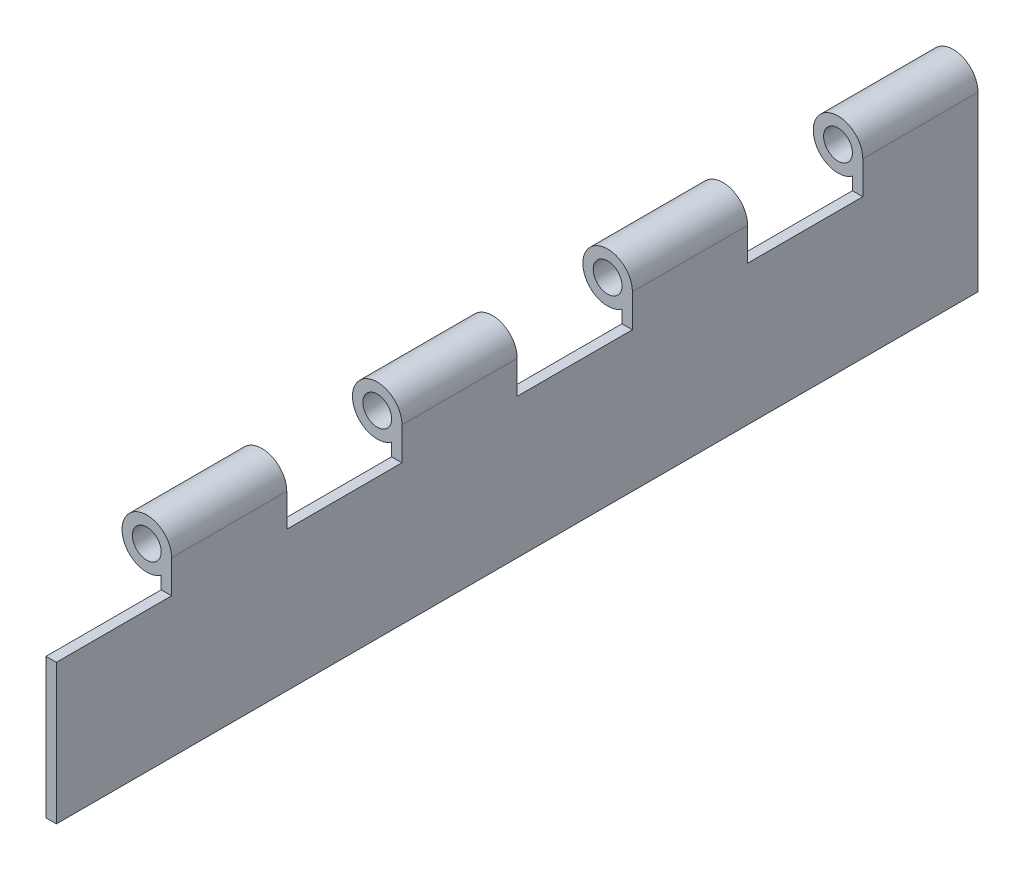
ISO-10303-21;
HEADER;
FILE_DESCRIPTION(('STEP AP214'),'2;1');
FILE_NAME('part.step','',(''),(''),'','','');
FILE_SCHEMA(('AUTOMOTIVE_DESIGN { 1 0 10303 214 1 1 1 1 }'));
ENDSEC;
DATA;
#1=APPLICATION_CONTEXT('core data for automotive mechanical design processes');
#2=APPLICATION_PROTOCOL_DEFINITION('international standard','automotive_design',2000,#1);
#3=PRODUCT_CONTEXT('',#1,'mechanical');
#4=PRODUCT('Part','Part','',(#3));
#5=PRODUCT_RELATED_PRODUCT_CATEGORY('part','',(#4));
#6=PRODUCT_DEFINITION_FORMATION('','',#4);
#7=PRODUCT_DEFINITION_CONTEXT('part definition',#1,'design');
#8=PRODUCT_DEFINITION('design','',#6,#7);
#9=PRODUCT_DEFINITION_SHAPE('','',#8);
#10=(LENGTH_UNIT() NAMED_UNIT(*) SI_UNIT(.MILLI.,.METRE.));
#11=(NAMED_UNIT(*) PLANE_ANGLE_UNIT() SI_UNIT($,.RADIAN.));
#12=(NAMED_UNIT(*) SI_UNIT($,.STERADIAN.) SOLID_ANGLE_UNIT());
#13=UNCERTAINTY_MEASURE_WITH_UNIT(LENGTH_MEASURE(1.E-05),#10,'distance_accuracy_value','');
#14=(GEOMETRIC_REPRESENTATION_CONTEXT(3) GLOBAL_UNCERTAINTY_ASSIGNED_CONTEXT((#13)) GLOBAL_UNIT_ASSIGNED_CONTEXT((#10,
#11,#12)) REPRESENTATION_CONTEXT('',''));
#15=CARTESIAN_POINT('',(0.,0.,0.));
#16=DIRECTION('',(0.,0.,1.));
#17=DIRECTION('',(1.,0.,0.));
#18=AXIS2_PLACEMENT_3D('',#15,#16,#17);
#19=CARTESIAN_POINT('',(0.,0.,203.2));
#20=DIRECTION('',(0.,0.,-1.));
#21=DIRECTION('',(-1.,0.,0.));
#22=AXIS2_PLACEMENT_3D('',#19,#20,#21);
#23=CYLINDRICAL_SURFACE('',#22,5.461);
#24=DIRECTION('',(0.,0.,-1.));
#25=VECTOR('',#24,1.);
#26=CARTESIAN_POINT('',(5.461,0.,203.2));
#27=LINE('',#26,#25);
#28=CARTESIAN_POINT('',(5.461,0.,177.8));
#29=VERTEX_POINT('',#28);
#30=CARTESIAN_POINT('',(5.461,0.,152.4));
#31=VERTEX_POINT('',#30);
#32=EDGE_CURVE('E295',#29,#31,#27,.T.);
#33=ORIENTED_EDGE('',*,*,#32,.T.);
#34=CARTESIAN_POINT('',(0.,0.,152.4));
#35=DIRECTION('',(0.,0.,1.));
#36=DIRECTION('',(1.,0.,0.));
#37=AXIS2_PLACEMENT_3D('',#34,#35,#36);
#38=CIRCLE('',#37,5.461);
#39=CARTESIAN_POINT('',(3.17500000000001,-4.44318534387211,152.4));
#40=VERTEX_POINT('',#39);
#41=EDGE_CURVE('E245',#31,#40,#38,.T.);
#42=ORIENTED_EDGE('',*,*,#41,.T.);
#43=DIRECTION('',(0.,0.,-1.));
#44=VECTOR('',#43,1.);
#45=CARTESIAN_POINT('',(3.17500000000001,-4.44318534387211,203.2));
#46=LINE('',#45,#44);
#47=CARTESIAN_POINT('',(3.17500000000001,-4.44318534387211,177.8));
#48=VERTEX_POINT('',#47);
#49=EDGE_CURVE('E11',#48,#40,#46,.T.);
#50=ORIENTED_EDGE('',*,*,#49,.F.);
#51=CARTESIAN_POINT('',(0.,0.,177.8));
#52=DIRECTION('',(0.,0.,-1.));
#53=DIRECTION('',(-1.,0.,0.));
#54=AXIS2_PLACEMENT_3D('',#51,#52,#53);
#55=CIRCLE('',#54,5.461);
#56=EDGE_CURVE('E269',#48,#29,#55,.T.);
#57=ORIENTED_EDGE('',*,*,#56,.T.);
#58=EDGE_LOOP('',(#33,#42,#50,#57));
#59=FACE_BOUND('',#58,.T.);
#60=ADVANCED_FACE('F36',(#59),#23,.T.);
#61=CARTESIAN_POINT('',(3.17500000000001,-4.44318534387211,127.));
#62=VERTEX_POINT('',#61);
#63=CARTESIAN_POINT('',(3.17500000000001,-4.44318534387211,101.6));
#64=VERTEX_POINT('',#63);
#65=EDGE_CURVE('E45',#62,#64,#46,.T.);
#66=ORIENTED_EDGE('',*,*,#65,.F.);
#67=CARTESIAN_POINT('',(0.,0.,127.));
#68=DIRECTION('',(0.,0.,-1.));
#69=DIRECTION('',(-1.,0.,0.));
#70=AXIS2_PLACEMENT_3D('',#67,#68,#69);
#71=CIRCLE('',#70,5.461);
#72=CARTESIAN_POINT('',(5.461,0.,127.));
#73=VERTEX_POINT('',#72);
#74=EDGE_CURVE('E240',#62,#73,#71,.T.);
#75=ORIENTED_EDGE('',*,*,#74,.T.);
#76=CARTESIAN_POINT('',(5.461,0.,101.6));
#77=VERTEX_POINT('',#76);
#78=EDGE_CURVE('E186',#73,#77,#27,.T.);
#79=ORIENTED_EDGE('',*,*,#78,.T.);
#80=CARTESIAN_POINT('',(0.,0.,101.6));
#81=DIRECTION('',(0.,0.,1.));
#82=DIRECTION('',(1.,0.,0.));
#83=AXIS2_PLACEMENT_3D('',#80,#81,#82);
#84=CIRCLE('',#83,5.461);
#85=EDGE_CURVE('E236',#77,#64,#84,.T.);
#86=ORIENTED_EDGE('',*,*,#85,.T.);
#87=EDGE_LOOP('',(#66,#75,#79,#86));
#88=FACE_BOUND('',#87,.T.);
#89=ADVANCED_FACE('F340',(#88),#23,.T.);
#90=CARTESIAN_POINT('',(3.17500000000001,-4.44318534387211,76.2));
#91=VERTEX_POINT('',#90);
#92=CARTESIAN_POINT('',(3.17500000000001,-4.44318534387211,50.8));
#93=VERTEX_POINT('',#92);
#94=EDGE_CURVE('E370',#91,#93,#46,.T.);
#95=ORIENTED_EDGE('',*,*,#94,.F.);
#96=CARTESIAN_POINT('',(0.,0.,76.2));
#97=DIRECTION('',(0.,0.,-1.));
#98=DIRECTION('',(-1.,0.,0.));
#99=AXIS2_PLACEMENT_3D('',#96,#97,#98);
#100=CIRCLE('',#99,5.461);
#101=CARTESIAN_POINT('',(5.461,0.,76.2));
#102=VERTEX_POINT('',#101);
#103=EDGE_CURVE('E230',#91,#102,#100,.T.);
#104=ORIENTED_EDGE('',*,*,#103,.T.);
#105=CARTESIAN_POINT('',(5.461,0.,50.8));
#106=VERTEX_POINT('',#105);
#107=EDGE_CURVE('E382',#102,#106,#27,.T.);
#108=ORIENTED_EDGE('',*,*,#107,.T.);
#109=CARTESIAN_POINT('',(0.,0.,50.8));
#110=DIRECTION('',(0.,0.,1.));
#111=DIRECTION('',(1.,0.,0.));
#112=AXIS2_PLACEMENT_3D('',#109,#110,#111);
#113=CIRCLE('',#112,5.461);
#114=EDGE_CURVE('E224',#106,#93,#113,.T.);
#115=ORIENTED_EDGE('',*,*,#114,.T.);
#116=EDGE_LOOP('',(#95,#104,#108,#115));
#117=FACE_BOUND('',#116,.T.);
#118=ADVANCED_FACE('F345',(#117),#23,.T.);
#119=CARTESIAN_POINT('',(0.,0.,203.2));
#120=DIRECTION('',(0.,0.,-1.));
#121=DIRECTION('',(-1.,0.,0.));
#122=AXIS2_PLACEMENT_3D('',#119,#120,#121);
#123=CYLINDRICAL_SURFACE('',#122,3.175);
#124=CARTESIAN_POINT('',(0.,0.,152.4));
#125=DIRECTION('',(0.,0.,1.));
#126=DIRECTION('',(1.,0.,0.));
#127=AXIS2_PLACEMENT_3D('',#124,#125,#126);
#128=CIRCLE('',#127,3.175);
#129=CARTESIAN_POINT('',(3.175,0.,152.4));
#130=VERTEX_POINT('',#129);
#131=EDGE_CURVE('E40',#130,#130,#128,.T.);
#132=ORIENTED_EDGE('',*,*,#131,.F.);
#133=EDGE_LOOP('',(#132));
#134=FACE_BOUND('',#133,.T.);
#135=CARTESIAN_POINT('',(0.,0.,177.8));
#136=DIRECTION('',(0.,0.,-1.));
#137=DIRECTION('',(-1.,0.,0.));
#138=AXIS2_PLACEMENT_3D('',#135,#136,#137);
#139=CIRCLE('',#138,3.175);
#140=CARTESIAN_POINT('',(-3.175,0.,177.8));
#141=VERTEX_POINT('',#140);
#142=EDGE_CURVE('E264',#141,#141,#139,.T.);
#143=ORIENTED_EDGE('',*,*,#142,.F.);
#144=EDGE_LOOP('',(#143));
#145=FACE_BOUND('',#144,.T.);
#146=ADVANCED_FACE('F323',(#134,#145),#123,.F.);
#147=CARTESIAN_POINT('',(0.,0.,203.2));
#148=DIRECTION('',(0.,0.,1.));
#149=DIRECTION('',(1.,0.,0.));
#150=AXIS2_PLACEMENT_3D('',#147,#148,#149);
#151=PLANE('',#150);
#152=DIRECTION('',(1.,0.,0.));
#153=VECTOR('',#152,1.);
#154=CARTESIAN_POINT('',(-5.461,-7.239,203.2));
#155=LINE('',#154,#153);
#156=CARTESIAN_POINT('',(3.17500000000001,-7.239,203.2));
#157=VERTEX_POINT('',#156);
#158=CARTESIAN_POINT('',(5.461,-7.239,203.2));
#159=VERTEX_POINT('',#158);
#160=EDGE_CURVE('E261',#157,#159,#155,.T.);
#161=ORIENTED_EDGE('',*,*,#160,.F.);
#162=DIRECTION('',(0.,-1.,0.));
#163=VECTOR('',#162,1.);
#164=CARTESIAN_POINT('',(3.17500000000001,-38.1,203.2));
#165=LINE('',#164,#163);
#166=CARTESIAN_POINT('',(3.17500000000001,-38.1,203.2));
#167=VERTEX_POINT('',#166);
#168=EDGE_CURVE('E278',#157,#167,#165,.T.);
#169=ORIENTED_EDGE('',*,*,#168,.T.);
#170=DIRECTION('',(1.,0.,0.));
#171=VECTOR('',#170,1.);
#172=CARTESIAN_POINT('',(5.461,-38.1,203.2));
#173=LINE('',#172,#171);
#174=CARTESIAN_POINT('',(5.461,-38.1,203.2));
#175=VERTEX_POINT('',#174);
#176=EDGE_CURVE('E280',#167,#175,#173,.T.);
#177=ORIENTED_EDGE('',*,*,#176,.T.);
#178=DIRECTION('',(0.,1.,0.));
#179=VECTOR('',#178,1.);
#180=CARTESIAN_POINT('',(5.461,0.,203.2));
#181=LINE('',#180,#179);
#182=EDGE_CURVE('E283',#175,#159,#181,.T.);
#183=ORIENTED_EDGE('',*,*,#182,.T.);
#184=EDGE_LOOP('',(#161,#169,#177,#183));
#185=FACE_BOUND('',#184,.T.);
#186=ADVANCED_FACE('F357',(#185),#151,.T.);
#187=CARTESIAN_POINT('',(0.,0.,0.));
#188=DIRECTION('',(0.,0.,1.));
#189=DIRECTION('',(1.,0.,0.));
#190=AXIS2_PLACEMENT_3D('',#187,#188,#189);
#191=PLANE('',#190);
#192=CARTESIAN_POINT('',(0.,0.,0.));
#193=DIRECTION('',(0.,0.,1.));
#194=DIRECTION('',(1.,0.,0.));
#195=AXIS2_PLACEMENT_3D('',#192,#193,#194);
#196=CIRCLE('',#195,5.461);
#197=CARTESIAN_POINT('',(5.461,0.,0.));
#198=VERTEX_POINT('',#197);
#199=CARTESIAN_POINT('',(3.17500000000001,-4.44318534387211,0.));
#200=VERTEX_POINT('',#199);
#201=EDGE_CURVE('E277',#198,#200,#196,.T.);
#202=ORIENTED_EDGE('',*,*,#201,.F.);
#203=DIRECTION('',(0.,1.,0.));
#204=VECTOR('',#203,1.);
#205=CARTESIAN_POINT('',(5.461,0.,0.));
#206=LINE('',#205,#204);
#207=CARTESIAN_POINT('',(5.461,-38.1,0.));
#208=VERTEX_POINT('',#207);
#209=EDGE_CURVE('E281',#208,#198,#206,.T.);
#210=ORIENTED_EDGE('',*,*,#209,.F.);
#211=DIRECTION('',(1.,0.,0.));
#212=VECTOR('',#211,1.);
#213=CARTESIAN_POINT('',(5.461,-38.1,0.));
#214=LINE('',#213,#212);
#215=CARTESIAN_POINT('',(3.17500000000001,-38.1,0.));
#216=VERTEX_POINT('',#215);
#217=EDGE_CURVE('E291',#216,#208,#214,.T.);
#218=ORIENTED_EDGE('',*,*,#217,.F.);
#219=DIRECTION('',(0.,-1.,0.));
#220=VECTOR('',#219,1.);
#221=CARTESIAN_POINT('',(3.17500000000001,-38.1,0.));
#222=LINE('',#221,#220);
#223=EDGE_CURVE('E289',#200,#216,#222,.T.);
#224=ORIENTED_EDGE('',*,*,#223,.F.);
#225=EDGE_LOOP('',(#202,#210,#218,#224));
#226=FACE_BOUND('',#225,.T.);
#227=CARTESIAN_POINT('',(0.,0.,0.));
#228=DIRECTION('',(0.,0.,1.));
#229=DIRECTION('',(1.,0.,0.));
#230=AXIS2_PLACEMENT_3D('',#227,#228,#229);
#231=CIRCLE('',#230,3.175);
#232=CARTESIAN_POINT('',(3.175,0.,0.));
#233=VERTEX_POINT('',#232);
#234=EDGE_CURVE('E274',#233,#233,#231,.T.);
#235=ORIENTED_EDGE('',*,*,#234,.T.);
#236=EDGE_LOOP('',(#235));
#237=FACE_BOUND('',#236,.T.);
#238=ADVANCED_FACE('F349',(#226,#237),#191,.F.);
#239=CARTESIAN_POINT('',(3.17500000000001,-4.44318534387211,25.4));
#240=VERTEX_POINT('',#239);
#241=EDGE_CURVE('E47',#240,#200,#46,.T.);
#242=ORIENTED_EDGE('',*,*,#241,.F.);
#243=CARTESIAN_POINT('',(0.,0.,25.4));
#244=DIRECTION('',(0.,0.,-1.));
#245=DIRECTION('',(-1.,0.,0.));
#246=AXIS2_PLACEMENT_3D('',#243,#244,#245);
#247=CIRCLE('',#246,5.461);
#248=CARTESIAN_POINT('',(5.461,0.,25.4));
#249=VERTEX_POINT('',#248);
#250=EDGE_CURVE('E218',#240,#249,#247,.T.);
#251=ORIENTED_EDGE('',*,*,#250,.T.);
#252=EDGE_CURVE('E286',#249,#198,#27,.T.);
#253=ORIENTED_EDGE('',*,*,#252,.T.);
#254=ORIENTED_EDGE('',*,*,#201,.T.);
#255=EDGE_LOOP('',(#242,#251,#253,#254));
#256=FACE_BOUND('',#255,.T.);
#257=ADVANCED_FACE('F38',(#256),#23,.T.);
#258=CARTESIAN_POINT('',(3.17500000000001,-38.1,203.2));
#259=DIRECTION('',(1.,0.,0.));
#260=DIRECTION('',(0.,1.,0.));
#261=AXIS2_PLACEMENT_3D('',#258,#259,#260);
#262=PLANE('',#261);
#263=ORIENTED_EDGE('',*,*,#49,.T.);
#264=DIRECTION('',(0.,-1.,0.));
#265=VECTOR('',#264,1.);
#266=CARTESIAN_POINT('',(3.17500000000001,-38.1,152.4));
#267=LINE('',#266,#265);
#268=CARTESIAN_POINT('',(3.17500000000001,-7.239,152.4));
#269=VERTEX_POINT('',#268);
#270=EDGE_CURVE('E242',#40,#269,#267,.T.);
#271=ORIENTED_EDGE('',*,*,#270,.T.);
#272=DIRECTION('',(0.,0.,-1.));
#273=VECTOR('',#272,1.);
#274=CARTESIAN_POINT('',(3.17500000000001,-7.239,203.2));
#275=LINE('',#274,#273);
#276=CARTESIAN_POINT('',(3.17500000000001,-7.239,127.));
#277=VERTEX_POINT('',#276);
#278=EDGE_CURVE('E253',#269,#277,#275,.T.);
#279=ORIENTED_EDGE('',*,*,#278,.T.);
#280=DIRECTION('',(0.,1.,0.));
#281=VECTOR('',#280,1.);
#282=CARTESIAN_POINT('',(3.17500000000001,-38.1,127.));
#283=LINE('',#282,#281);
#284=EDGE_CURVE('E173',#277,#62,#283,.T.);
#285=ORIENTED_EDGE('',*,*,#284,.T.);
#286=ORIENTED_EDGE('',*,*,#65,.T.);
#287=DIRECTION('',(0.,-1.,0.));
#288=VECTOR('',#287,1.);
#289=CARTESIAN_POINT('',(3.17500000000001,-38.1,101.6));
#290=LINE('',#289,#288);
#291=CARTESIAN_POINT('',(3.17500000000001,-7.239,101.6));
#292=VERTEX_POINT('',#291);
#293=EDGE_CURVE('E233',#64,#292,#290,.T.);
#294=ORIENTED_EDGE('',*,*,#293,.T.);
#295=DIRECTION('',(0.,0.,-1.));
#296=VECTOR('',#295,1.);
#297=CARTESIAN_POINT('',(3.17500000000001,-7.239,203.2));
#298=LINE('',#297,#296);
#299=CARTESIAN_POINT('',(3.17500000000001,-7.239,76.2));
#300=VERTEX_POINT('',#299);
#301=EDGE_CURVE('E250',#292,#300,#298,.T.);
#302=ORIENTED_EDGE('',*,*,#301,.T.);
#303=DIRECTION('',(0.,1.,0.));
#304=VECTOR('',#303,1.);
#305=CARTESIAN_POINT('',(3.17500000000001,-38.1,76.2));
#306=LINE('',#305,#304);
#307=EDGE_CURVE('E227',#300,#91,#306,.T.);
#308=ORIENTED_EDGE('',*,*,#307,.T.);
#309=ORIENTED_EDGE('',*,*,#94,.T.);
#310=DIRECTION('',(0.,-1.,0.));
#311=VECTOR('',#310,1.);
#312=CARTESIAN_POINT('',(3.17500000000001,-38.1,50.8));
#313=LINE('',#312,#311);
#314=CARTESIAN_POINT('',(3.17500000000001,-7.239,50.8));
#315=VERTEX_POINT('',#314);
#316=EDGE_CURVE('E221',#93,#315,#313,.T.);
#317=ORIENTED_EDGE('',*,*,#316,.T.);
#318=DIRECTION('',(0.,0.,-1.));
#319=VECTOR('',#318,1.);
#320=CARTESIAN_POINT('',(3.17500000000001,-7.239,203.2));
#321=LINE('',#320,#319);
#322=CARTESIAN_POINT('',(3.17500000000001,-7.239,25.4));
#323=VERTEX_POINT('',#322);
#324=EDGE_CURVE('E247',#315,#323,#321,.T.);
#325=ORIENTED_EDGE('',*,*,#324,.T.);
#326=DIRECTION('',(0.,1.,0.));
#327=VECTOR('',#326,1.);
#328=CARTESIAN_POINT('',(3.17500000000001,-38.1,25.4));
#329=LINE('',#328,#327);
#330=EDGE_CURVE('E215',#323,#240,#329,.T.);
#331=ORIENTED_EDGE('',*,*,#330,.T.);
#332=ORIENTED_EDGE('',*,*,#241,.T.);
#333=ORIENTED_EDGE('',*,*,#223,.T.);
#334=DIRECTION('',(0.,0.,-1.));
#335=VECTOR('',#334,1.);
#336=CARTESIAN_POINT('',(3.17500000000001,-38.1,203.2));
#337=LINE('',#336,#335);
#338=EDGE_CURVE('E301',#167,#216,#337,.T.);
#339=ORIENTED_EDGE('',*,*,#338,.F.);
#340=ORIENTED_EDGE('',*,*,#168,.F.);
#341=DIRECTION('',(0.,0.,-1.));
#342=VECTOR('',#341,1.);
#343=CARTESIAN_POINT('',(3.17500000000001,-7.239,203.2));
#344=LINE('',#343,#342);
#345=CARTESIAN_POINT('',(3.17500000000001,-7.239,177.8));
#346=VERTEX_POINT('',#345);
#347=EDGE_CURVE('E271',#157,#346,#344,.T.);
#348=ORIENTED_EDGE('',*,*,#347,.T.);
#349=DIRECTION('',(0.,1.,0.));
#350=VECTOR('',#349,1.);
#351=CARTESIAN_POINT('',(3.17500000000001,-38.1,177.8));
#352=LINE('',#351,#350);
#353=EDGE_CURVE('E266',#346,#48,#352,.T.);
#354=ORIENTED_EDGE('',*,*,#353,.T.);
#355=EDGE_LOOP('',(#263,#271,#279,#285,#286,#294,#302,#308,#309,#317,#325,#331,#332,#333,#339,
#340,#348,#354));
#356=FACE_BOUND('',#355,.T.);
#357=ADVANCED_FACE('F348',(#356),#262,.F.);
#358=CARTESIAN_POINT('',(5.461,-38.1,203.2));
#359=DIRECTION('',(0.,1.,0.));
#360=DIRECTION('',(0.,0.,1.));
#361=AXIS2_PLACEMENT_3D('',#358,#359,#360);
#362=PLANE('',#361);
#363=ORIENTED_EDGE('',*,*,#217,.T.);
#364=DIRECTION('',(0.,0.,-1.));
#365=VECTOR('',#364,1.);
#366=CARTESIAN_POINT('',(5.461,-38.1,203.2));
#367=LINE('',#366,#365);
#368=EDGE_CURVE('E298',#175,#208,#367,.T.);
#369=ORIENTED_EDGE('',*,*,#368,.F.);
#370=ORIENTED_EDGE('',*,*,#176,.F.);
#371=ORIENTED_EDGE('',*,*,#338,.T.);
#372=EDGE_LOOP('',(#363,#369,#370,#371));
#373=FACE_BOUND('',#372,.T.);
#374=ADVANCED_FACE('F355',(#373),#362,.F.);
#375=CARTESIAN_POINT('',(5.461,0.,203.2));
#376=DIRECTION('',(-1.,0.,0.));
#377=DIRECTION('',(0.,-1.,0.));
#378=AXIS2_PLACEMENT_3D('',#375,#376,#377);
#379=PLANE('',#378);
#380=DIRECTION('',(0.,0.,-1.));
#381=VECTOR('',#380,1.);
#382=CARTESIAN_POINT('',(5.461,-7.239,152.4));
#383=LINE('',#382,#381);
#384=CARTESIAN_POINT('',(5.461,-7.239,152.4));
#385=VERTEX_POINT('',#384);
#386=CARTESIAN_POINT('',(5.461,-7.239,127.));
#387=VERTEX_POINT('',#386);
#388=EDGE_CURVE('E180',#385,#387,#383,.T.);
#389=ORIENTED_EDGE('',*,*,#388,.F.);
#390=DIRECTION('',(0.,-1.,0.));
#391=VECTOR('',#390,1.);
#392=CARTESIAN_POINT('',(5.461,5.461,152.4));
#393=LINE('',#392,#391);
#394=EDGE_CURVE('E54',#31,#385,#393,.T.);
#395=ORIENTED_EDGE('',*,*,#394,.F.);
#396=ORIENTED_EDGE('',*,*,#32,.F.);
#397=DIRECTION('',(0.,1.,0.));
#398=VECTOR('',#397,1.);
#399=CARTESIAN_POINT('',(5.461,5.461,177.8));
#400=LINE('',#399,#398);
#401=CARTESIAN_POINT('',(5.461,-7.239,177.8));
#402=VERTEX_POINT('',#401);
#403=EDGE_CURVE('E258',#402,#29,#400,.T.);
#404=ORIENTED_EDGE('',*,*,#403,.F.);
#405=DIRECTION('',(0.,0.,-1.));
#406=VECTOR('',#405,1.);
#407=CARTESIAN_POINT('',(5.461,-7.239,203.2));
#408=LINE('',#407,#406);
#409=EDGE_CURVE('E255',#159,#402,#408,.T.);
#410=ORIENTED_EDGE('',*,*,#409,.F.);
#411=ORIENTED_EDGE('',*,*,#182,.F.);
#412=ORIENTED_EDGE('',*,*,#368,.T.);
#413=ORIENTED_EDGE('',*,*,#209,.T.);
#414=ORIENTED_EDGE('',*,*,#252,.F.);
#415=DIRECTION('',(0.,1.,0.));
#416=VECTOR('',#415,1.);
#417=CARTESIAN_POINT('',(5.461,5.461,25.4));
#418=LINE('',#417,#416);
#419=CARTESIAN_POINT('',(5.461,-7.239,25.4));
#420=VERTEX_POINT('',#419);
#421=EDGE_CURVE('E208',#420,#249,#418,.T.);
#422=ORIENTED_EDGE('',*,*,#421,.F.);
#423=DIRECTION('',(0.,0.,-1.));
#424=VECTOR('',#423,1.);
#425=CARTESIAN_POINT('',(5.461,-7.239,50.8));
#426=LINE('',#425,#424);
#427=CARTESIAN_POINT('',(5.461,-7.239,50.8));
#428=VERTEX_POINT('',#427);
#429=EDGE_CURVE('E205',#428,#420,#426,.T.);
#430=ORIENTED_EDGE('',*,*,#429,.F.);
#431=DIRECTION('',(0.,-1.,0.));
#432=VECTOR('',#431,1.);
#433=CARTESIAN_POINT('',(5.461,5.461,50.8));
#434=LINE('',#433,#432);
#435=EDGE_CURVE('E203',#106,#428,#434,.T.);
#436=ORIENTED_EDGE('',*,*,#435,.F.);
#437=ORIENTED_EDGE('',*,*,#107,.F.);
#438=DIRECTION('',(0.,1.,0.));
#439=VECTOR('',#438,1.);
#440=CARTESIAN_POINT('',(5.461,5.461,76.2));
#441=LINE('',#440,#439);
#442=CARTESIAN_POINT('',(5.461,-7.239,76.2));
#443=VERTEX_POINT('',#442);
#444=EDGE_CURVE('E196',#443,#102,#441,.T.);
#445=ORIENTED_EDGE('',*,*,#444,.F.);
#446=DIRECTION('',(0.,0.,-1.));
#447=VECTOR('',#446,1.);
#448=CARTESIAN_POINT('',(5.461,-7.239,101.6));
#449=LINE('',#448,#447);
#450=CARTESIAN_POINT('',(5.461,-7.239,101.6));
#451=VERTEX_POINT('',#450);
#452=EDGE_CURVE('E192',#451,#443,#449,.T.);
#453=ORIENTED_EDGE('',*,*,#452,.F.);
#454=DIRECTION('',(0.,-1.,0.));
#455=VECTOR('',#454,1.);
#456=CARTESIAN_POINT('',(5.461,5.461,101.6));
#457=LINE('',#456,#455);
#458=EDGE_CURVE('E62',#77,#451,#457,.T.);
#459=ORIENTED_EDGE('',*,*,#458,.F.);
#460=ORIENTED_EDGE('',*,*,#78,.F.);
#461=DIRECTION('',(0.,1.,0.));
#462=VECTOR('',#461,1.);
#463=CARTESIAN_POINT('',(5.461,5.461,127.));
#464=LINE('',#463,#462);
#465=EDGE_CURVE('E170',#387,#73,#464,.T.);
#466=ORIENTED_EDGE('',*,*,#465,.F.);
#467=EDGE_LOOP('',(#389,#395,#396,#404,#410,#411,#412,#413,#414,#422,#430,#436,#437,#445,#453,
#459,#460,#466));
#468=FACE_BOUND('',#467,.T.);
#469=ADVANCED_FACE('F184',(#468),#379,.F.);
#470=CARTESIAN_POINT('',(0.,0.,25.4));
#471=DIRECTION('',(0.,0.,-1.));
#472=DIRECTION('',(-1.,0.,0.));
#473=AXIS2_PLACEMENT_3D('',#470,#471,#472);
#474=CIRCLE('',#473,3.175);
#475=CARTESIAN_POINT('',(-3.175,0.,25.4));
#476=VERTEX_POINT('',#475);
#477=EDGE_CURVE('E176',#476,#476,#474,.T.);
#478=ORIENTED_EDGE('',*,*,#477,.F.);
#479=EDGE_LOOP('',(#478));
#480=FACE_BOUND('',#479,.T.);
#481=ORIENTED_EDGE('',*,*,#234,.F.);
#482=EDGE_LOOP('',(#481));
#483=FACE_BOUND('',#482,.T.);
#484=ADVANCED_FACE('F367',(#480,#483),#123,.F.);
#485=CARTESIAN_POINT('',(-5.461,-7.239,203.2));
#486=DIRECTION('',(0.,-1.,0.));
#487=DIRECTION('',(1.,0.,0.));
#488=AXIS2_PLACEMENT_3D('',#485,#486,#487);
#489=PLANE('',#488);
#490=ORIENTED_EDGE('',*,*,#160,.T.);
#491=ORIENTED_EDGE('',*,*,#409,.T.);
#492=DIRECTION('',(1.,0.,0.));
#493=VECTOR('',#492,1.);
#494=CARTESIAN_POINT('',(-5.461,-7.239,177.8));
#495=LINE('',#494,#493);
#496=EDGE_CURVE('E262',#346,#402,#495,.T.);
#497=ORIENTED_EDGE('',*,*,#496,.F.);
#498=ORIENTED_EDGE('',*,*,#347,.F.);
#499=EDGE_LOOP('',(#490,#491,#497,#498));
#500=FACE_BOUND('',#499,.T.);
#501=ADVANCED_FACE('F392',(#500),#489,.F.);
#502=CARTESIAN_POINT('',(-5.461,5.461,177.8));
#503=DIRECTION('',(0.,0.,-1.));
#504=DIRECTION('',(-1.,0.,0.));
#505=AXIS2_PLACEMENT_3D('',#502,#503,#504);
#506=PLANE('',#505);
#507=ORIENTED_EDGE('',*,*,#142,.T.);
#508=EDGE_LOOP('',(#507));
#509=FACE_BOUND('',#508,.T.);
#510=ORIENTED_EDGE('',*,*,#56,.F.);
#511=ORIENTED_EDGE('',*,*,#353,.F.);
#512=ORIENTED_EDGE('',*,*,#496,.T.);
#513=ORIENTED_EDGE('',*,*,#403,.T.);
#514=EDGE_LOOP('',(#510,#511,#512,#513));
#515=FACE_BOUND('',#514,.T.);
#516=ADVANCED_FACE('F397',(#509,#515),#506,.F.);
#517=CARTESIAN_POINT('',(-5.46100000000001,-7.239,50.8));
#518=DIRECTION('',(0.,-1.,0.));
#519=DIRECTION('',(1.,0.,0.));
#520=AXIS2_PLACEMENT_3D('',#517,#518,#519);
#521=PLANE('',#520);
#522=DIRECTION('',(1.,0.,0.));
#523=VECTOR('',#522,1.);
#524=CARTESIAN_POINT('',(-5.46100000000001,-7.239,50.8));
#525=LINE('',#524,#523);
#526=EDGE_CURVE('E211',#315,#428,#525,.T.);
#527=ORIENTED_EDGE('',*,*,#526,.T.);
#528=ORIENTED_EDGE('',*,*,#429,.T.);
#529=DIRECTION('',(1.,0.,0.));
#530=VECTOR('',#529,1.);
#531=CARTESIAN_POINT('',(-5.46100000000001,-7.239,25.4));
#532=LINE('',#531,#530);
#533=EDGE_CURVE('E193',#323,#420,#532,.T.);
#534=ORIENTED_EDGE('',*,*,#533,.F.);
#535=ORIENTED_EDGE('',*,*,#324,.F.);
#536=EDGE_LOOP('',(#527,#528,#534,#535));
#537=FACE_BOUND('',#536,.T.);
#538=ADVANCED_FACE('F414',(#537),#521,.F.);
#539=CARTESIAN_POINT('',(-5.46100000000001,5.461,50.8));
#540=DIRECTION('',(0.,0.,1.));
#541=DIRECTION('',(1.,0.,0.));
#542=AXIS2_PLACEMENT_3D('',#539,#540,#541);
#543=PLANE('',#542);
#544=CARTESIAN_POINT('',(0.,0.,50.8));
#545=DIRECTION('',(0.,0.,1.));
#546=DIRECTION('',(1.,0.,0.));
#547=AXIS2_PLACEMENT_3D('',#544,#545,#546);
#548=CIRCLE('',#547,3.175);
#549=CARTESIAN_POINT('',(3.175,0.,50.8));
#550=VERTEX_POINT('',#549);
#551=EDGE_CURVE('E220',#550,#550,#548,.T.);
#552=ORIENTED_EDGE('',*,*,#551,.T.);
#553=EDGE_LOOP('',(#552));
#554=FACE_BOUND('',#553,.T.);
#555=ORIENTED_EDGE('',*,*,#435,.T.);
#556=ORIENTED_EDGE('',*,*,#526,.F.);
#557=ORIENTED_EDGE('',*,*,#316,.F.);
#558=ORIENTED_EDGE('',*,*,#114,.F.);
#559=EDGE_LOOP('',(#555,#556,#557,#558));
#560=FACE_BOUND('',#559,.T.);
#561=ADVANCED_FACE('F412',(#554,#560),#543,.F.);
#562=CARTESIAN_POINT('',(-5.46100000000001,5.461,25.4));
#563=DIRECTION('',(0.,0.,-1.));
#564=DIRECTION('',(-1.,0.,0.));
#565=AXIS2_PLACEMENT_3D('',#562,#563,#564);
#566=PLANE('',#565);
#567=ORIENTED_EDGE('',*,*,#477,.T.);
#568=EDGE_LOOP('',(#567));
#569=FACE_BOUND('',#568,.T.);
#570=ORIENTED_EDGE('',*,*,#250,.F.);
#571=ORIENTED_EDGE('',*,*,#330,.F.);
#572=ORIENTED_EDGE('',*,*,#533,.T.);
#573=ORIENTED_EDGE('',*,*,#421,.T.);
#574=EDGE_LOOP('',(#570,#571,#572,#573));
#575=FACE_BOUND('',#574,.T.);
#576=ADVANCED_FACE('F417',(#569,#575),#566,.F.);
#577=CARTESIAN_POINT('',(0.,0.,76.2));
#578=DIRECTION('',(0.,0.,-1.));
#579=DIRECTION('',(-1.,0.,0.));
#580=AXIS2_PLACEMENT_3D('',#577,#578,#579);
#581=CIRCLE('',#580,3.175);
#582=CARTESIAN_POINT('',(-3.175,0.,76.2));
#583=VERTEX_POINT('',#582);
#584=EDGE_CURVE('E226',#583,#583,#581,.T.);
#585=ORIENTED_EDGE('',*,*,#584,.F.);
#586=EDGE_LOOP('',(#585));
#587=FACE_BOUND('',#586,.T.);
#588=ORIENTED_EDGE('',*,*,#551,.F.);
#589=EDGE_LOOP('',(#588));
#590=FACE_BOUND('',#589,.T.);
#591=ADVANCED_FACE('F322',(#587,#590),#123,.F.);
#592=CARTESIAN_POINT('',(-5.46100000000001,-7.239,101.6));
#593=DIRECTION('',(0.,-1.,0.));
#594=DIRECTION('',(1.,0.,0.));
#595=AXIS2_PLACEMENT_3D('',#592,#593,#594);
#596=PLANE('',#595);
#597=DIRECTION('',(1.,0.,0.));
#598=VECTOR('',#597,1.);
#599=CARTESIAN_POINT('',(-5.46100000000001,-7.239,101.6));
#600=LINE('',#599,#598);
#601=EDGE_CURVE('E199',#292,#451,#600,.T.);
#602=ORIENTED_EDGE('',*,*,#601,.T.);
#603=ORIENTED_EDGE('',*,*,#452,.T.);
#604=DIRECTION('',(1.,0.,0.));
#605=VECTOR('',#604,1.);
#606=CARTESIAN_POINT('',(-5.46100000000001,-7.239,76.2));
#607=LINE('',#606,#605);
#608=EDGE_CURVE('E200',#300,#443,#607,.T.);
#609=ORIENTED_EDGE('',*,*,#608,.F.);
#610=ORIENTED_EDGE('',*,*,#301,.F.);
#611=EDGE_LOOP('',(#602,#603,#609,#610));
#612=FACE_BOUND('',#611,.T.);
#613=ADVANCED_FACE('F328',(#612),#596,.F.);
#614=CARTESIAN_POINT('',(-5.46100000000001,5.461,101.6));
#615=DIRECTION('',(0.,0.,1.));
#616=DIRECTION('',(1.,0.,0.));
#617=AXIS2_PLACEMENT_3D('',#614,#615,#616);
#618=PLANE('',#617);
#619=CARTESIAN_POINT('',(0.,0.,101.6));
#620=DIRECTION('',(0.,0.,1.));
#621=DIRECTION('',(1.,0.,0.));
#622=AXIS2_PLACEMENT_3D('',#619,#620,#621);
#623=CIRCLE('',#622,3.175);
#624=CARTESIAN_POINT('',(3.175,0.,101.6));
#625=VERTEX_POINT('',#624);
#626=EDGE_CURVE('E232',#625,#625,#623,.T.);
#627=ORIENTED_EDGE('',*,*,#626,.T.);
#628=EDGE_LOOP('',(#627));
#629=FACE_BOUND('',#628,.T.);
#630=ORIENTED_EDGE('',*,*,#458,.T.);
#631=ORIENTED_EDGE('',*,*,#601,.F.);
#632=ORIENTED_EDGE('',*,*,#293,.F.);
#633=ORIENTED_EDGE('',*,*,#85,.F.);
#634=EDGE_LOOP('',(#630,#631,#632,#633));
#635=FACE_BOUND('',#634,.T.);
#636=ADVANCED_FACE('F326',(#629,#635),#618,.F.);
#637=CARTESIAN_POINT('',(-5.46100000000001,5.461,76.2));
#638=DIRECTION('',(0.,0.,-1.));
#639=DIRECTION('',(-1.,0.,0.));
#640=AXIS2_PLACEMENT_3D('',#637,#638,#639);
#641=PLANE('',#640);
#642=ORIENTED_EDGE('',*,*,#584,.T.);
#643=EDGE_LOOP('',(#642));
#644=FACE_BOUND('',#643,.T.);
#645=ORIENTED_EDGE('',*,*,#103,.F.);
#646=ORIENTED_EDGE('',*,*,#307,.F.);
#647=ORIENTED_EDGE('',*,*,#608,.T.);
#648=ORIENTED_EDGE('',*,*,#444,.T.);
#649=EDGE_LOOP('',(#645,#646,#647,#648));
#650=FACE_BOUND('',#649,.T.);
#651=ADVANCED_FACE('F320',(#644,#650),#641,.F.);
#652=CARTESIAN_POINT('',(0.,0.,127.));
#653=DIRECTION('',(0.,0.,-1.));
#654=DIRECTION('',(-1.,0.,0.));
#655=AXIS2_PLACEMENT_3D('',#652,#653,#654);
#656=CIRCLE('',#655,3.175);
#657=CARTESIAN_POINT('',(-3.175,0.,127.));
#658=VERTEX_POINT('',#657);
#659=EDGE_CURVE('E238',#658,#658,#656,.T.);
#660=ORIENTED_EDGE('',*,*,#659,.F.);
#661=EDGE_LOOP('',(#660));
#662=FACE_BOUND('',#661,.T.);
#663=ORIENTED_EDGE('',*,*,#626,.F.);
#664=EDGE_LOOP('',(#663));
#665=FACE_BOUND('',#664,.T.);
#666=ADVANCED_FACE('F317',(#662,#665),#123,.F.);
#667=CARTESIAN_POINT('',(-5.46100000000001,-7.239,152.4));
#668=DIRECTION('',(0.,-1.,0.));
#669=DIRECTION('',(1.,0.,0.));
#670=AXIS2_PLACEMENT_3D('',#667,#668,#669);
#671=PLANE('',#670);
#672=DIRECTION('',(1.,0.,0.));
#673=VECTOR('',#672,1.);
#674=CARTESIAN_POINT('',(-5.46100000000001,-7.239,152.4));
#675=LINE('',#674,#673);
#676=EDGE_CURVE('E177',#269,#385,#675,.T.);
#677=ORIENTED_EDGE('',*,*,#676,.T.);
#678=ORIENTED_EDGE('',*,*,#388,.T.);
#679=DIRECTION('',(1.,0.,0.));
#680=VECTOR('',#679,1.);
#681=CARTESIAN_POINT('',(-5.46100000000001,-7.239,127.));
#682=LINE('',#681,#680);
#683=EDGE_CURVE('E166',#277,#387,#682,.T.);
#684=ORIENTED_EDGE('',*,*,#683,.F.);
#685=ORIENTED_EDGE('',*,*,#278,.F.);
#686=EDGE_LOOP('',(#677,#678,#684,#685));
#687=FACE_BOUND('',#686,.T.);
#688=ADVANCED_FACE('F181',(#687),#671,.F.);
#689=CARTESIAN_POINT('',(-5.46100000000001,5.461,152.4));
#690=DIRECTION('',(0.,0.,1.));
#691=DIRECTION('',(1.,0.,0.));
#692=AXIS2_PLACEMENT_3D('',#689,#690,#691);
#693=PLANE('',#692);
#694=ORIENTED_EDGE('',*,*,#131,.T.);
#695=EDGE_LOOP('',(#694));
#696=FACE_BOUND('',#695,.T.);
#697=ORIENTED_EDGE('',*,*,#394,.T.);
#698=ORIENTED_EDGE('',*,*,#676,.F.);
#699=ORIENTED_EDGE('',*,*,#270,.F.);
#700=ORIENTED_EDGE('',*,*,#41,.F.);
#701=EDGE_LOOP('',(#697,#698,#699,#700));
#702=FACE_BOUND('',#701,.T.);
#703=ADVANCED_FACE('F400',(#696,#702),#693,.F.);
#704=CARTESIAN_POINT('',(-5.46100000000001,5.461,127.));
#705=DIRECTION('',(0.,0.,-1.));
#706=DIRECTION('',(-1.,0.,0.));
#707=AXIS2_PLACEMENT_3D('',#704,#705,#706);
#708=PLANE('',#707);
#709=ORIENTED_EDGE('',*,*,#659,.T.);
#710=EDGE_LOOP('',(#709));
#711=FACE_BOUND('',#710,.T.);
#712=ORIENTED_EDGE('',*,*,#74,.F.);
#713=ORIENTED_EDGE('',*,*,#284,.F.);
#714=ORIENTED_EDGE('',*,*,#683,.T.);
#715=ORIENTED_EDGE('',*,*,#465,.T.);
#716=EDGE_LOOP('',(#712,#713,#714,#715));
#717=FACE_BOUND('',#716,.T.);
#718=ADVANCED_FACE('F168',(#711,#717),#708,.F.);
#719=CLOSED_SHELL('',(#60,#89,#118,#146,#186,#238,#257,#357,#374,#469,#484,#501,#516,#538,#561,
#576,#591,#613,#636,#651,#666,#688,#703,#718));
#720=MANIFOLD_SOLID_BREP('B2',#719);
#721=ADVANCED_BREP_SHAPE_REPRESENTATION('',(#18,#720),#14);
#722=SHAPE_DEFINITION_REPRESENTATION(#9,#721);
ENDSEC;
END-ISO-10303-21;
